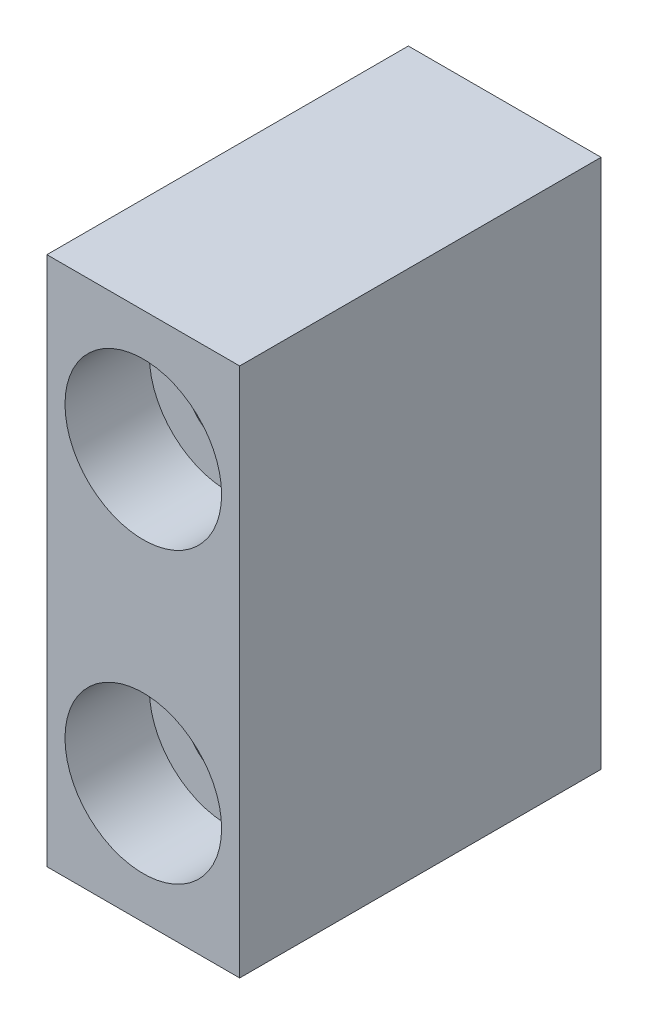
ISO-10303-21;
HEADER;
FILE_DESCRIPTION(('STEP AP214'),'2;1');
FILE_NAME('part.step','',(''),(''),'','','');
FILE_SCHEMA(('AUTOMOTIVE_DESIGN { 1 0 10303 214 1 1 1 1 }'));
ENDSEC;
DATA;
#1=APPLICATION_CONTEXT('core data for automotive mechanical design processes');
#2=APPLICATION_PROTOCOL_DEFINITION('international standard','automotive_design',2000,#1);
#3=PRODUCT_CONTEXT('',#1,'mechanical');
#4=PRODUCT('Part','Part','',(#3));
#5=PRODUCT_RELATED_PRODUCT_CATEGORY('part','',(#4));
#6=PRODUCT_DEFINITION_FORMATION('','',#4);
#7=PRODUCT_DEFINITION_CONTEXT('part definition',#1,'design');
#8=PRODUCT_DEFINITION('design','',#6,#7);
#9=PRODUCT_DEFINITION_SHAPE('','',#8);
#10=(LENGTH_UNIT() NAMED_UNIT(*) SI_UNIT(.MILLI.,.METRE.));
#11=(NAMED_UNIT(*) PLANE_ANGLE_UNIT() SI_UNIT($,.RADIAN.));
#12=(NAMED_UNIT(*) SI_UNIT($,.STERADIAN.) SOLID_ANGLE_UNIT());
#13=UNCERTAINTY_MEASURE_WITH_UNIT(LENGTH_MEASURE(1.E-05),#10,'distance_accuracy_value','');
#14=(GEOMETRIC_REPRESENTATION_CONTEXT(3) GLOBAL_UNCERTAINTY_ASSIGNED_CONTEXT((#13)) GLOBAL_UNIT_ASSIGNED_CONTEXT((#10,
#11,#12)) REPRESENTATION_CONTEXT('',''));
#15=CARTESIAN_POINT('',(0.,0.,0.));
#16=DIRECTION('',(0.,0.,1.));
#17=DIRECTION('',(1.,0.,0.));
#18=AXIS2_PLACEMENT_3D('',#15,#16,#17);
#19=CARTESIAN_POINT('',(-4.,-9.70103092783504,0.));
#20=DIRECTION('',(0.,0.,1.));
#21=DIRECTION('',(1.,0.,0.));
#22=AXIS2_PLACEMENT_3D('',#19,#20,#21);
#23=CYLINDRICAL_SURFACE('',#22,1.75);
#24=CARTESIAN_POINT('',(-4.,-9.70103092783504,0.));
#25=DIRECTION('',(0.,0.,1.));
#26=DIRECTION('',(1.,0.,0.));
#27=AXIS2_PLACEMENT_3D('',#24,#25,#26);
#28=CIRCLE('',#27,1.75);
#29=CARTESIAN_POINT('',(-2.25,-9.70103092783504,0.));
#30=VERTEX_POINT('',#29);
#31=EDGE_CURVE('E110',#30,#30,#28,.T.);
#32=ORIENTED_EDGE('',*,*,#31,.F.);
#33=EDGE_LOOP('',(#32));
#34=FACE_BOUND('',#33,.T.);
#35=CARTESIAN_POINT('',(-4.,-9.70103092783504,11.5));
#36=DIRECTION('',(0.,0.,1.));
#37=DIRECTION('',(1.,0.,0.));
#38=AXIS2_PLACEMENT_3D('',#35,#36,#37);
#39=CIRCLE('',#38,1.75);
#40=CARTESIAN_POINT('',(-2.25,-9.70103092783504,11.5));
#41=VERTEX_POINT('',#40);
#42=EDGE_CURVE('E37',#41,#41,#39,.F.);
#43=ORIENTED_EDGE('',*,*,#42,.F.);
#44=EDGE_LOOP('',(#43));
#45=FACE_BOUND('',#44,.T.);
#46=ADVANCED_FACE('F33',(#34,#45),#23,.F.);
#47=CARTESIAN_POINT('',(-3.99999999999999,2.29896907216496,0.));
#48=DIRECTION('',(0.,0.,1.));
#49=DIRECTION('',(1.,0.,0.));
#50=AXIS2_PLACEMENT_3D('',#47,#48,#49);
#51=CYLINDRICAL_SURFACE('',#50,1.75);
#52=CARTESIAN_POINT('',(-3.99999999999999,2.29896907216496,0.));
#53=DIRECTION('',(0.,0.,1.));
#54=DIRECTION('',(1.,0.,0.));
#55=AXIS2_PLACEMENT_3D('',#52,#53,#54);
#56=CIRCLE('',#55,1.75);
#57=CARTESIAN_POINT('',(-2.25,2.29896907216496,0.));
#58=VERTEX_POINT('',#57);
#59=EDGE_CURVE('E103',#58,#58,#56,.T.);
#60=ORIENTED_EDGE('',*,*,#59,.F.);
#61=EDGE_LOOP('',(#60));
#62=FACE_BOUND('',#61,.T.);
#63=CARTESIAN_POINT('',(-3.99999999999999,2.29896907216496,11.5));
#64=DIRECTION('',(0.,0.,1.));
#65=DIRECTION('',(1.,0.,0.));
#66=AXIS2_PLACEMENT_3D('',#63,#64,#65);
#67=CIRCLE('',#66,1.75);
#68=CARTESIAN_POINT('',(-2.25,2.29896907216496,11.5));
#69=VERTEX_POINT('',#68);
#70=EDGE_CURVE('E108',#69,#69,#67,.F.);
#71=ORIENTED_EDGE('',*,*,#70,.F.);
#72=EDGE_LOOP('',(#71));
#73=FACE_BOUND('',#72,.T.);
#74=ADVANCED_FACE('F133',(#62,#73),#51,.F.);
#75=CARTESIAN_POINT('',(-8.,7.29896907216496,15.));
#76=DIRECTION('',(1.,0.,0.));
#77=DIRECTION('',(0.,1.,0.));
#78=AXIS2_PLACEMENT_3D('',#75,#76,#77);
#79=PLANE('',#78);
#80=DIRECTION('',(0.,-1.,0.));
#81=VECTOR('',#80,1.);
#82=CARTESIAN_POINT('',(-8.,7.29896907216496,0.));
#83=LINE('',#82,#81);
#84=CARTESIAN_POINT('',(-8.,7.29896907216496,0.));
#85=VERTEX_POINT('',#84);
#86=CARTESIAN_POINT('',(-7.99999999999999,-14.701030927835,0.));
#87=VERTEX_POINT('',#86);
#88=EDGE_CURVE('E100',#85,#87,#83,.T.);
#89=ORIENTED_EDGE('',*,*,#88,.T.);
#90=DIRECTION('',(0.,0.,-1.));
#91=VECTOR('',#90,1.);
#92=CARTESIAN_POINT('',(-7.99999999999999,-14.701030927835,15.));
#93=LINE('',#92,#91);
#94=CARTESIAN_POINT('',(-7.99999999999999,-14.701030927835,15.));
#95=VERTEX_POINT('',#94);
#96=EDGE_CURVE('E11',#95,#87,#93,.T.);
#97=ORIENTED_EDGE('',*,*,#96,.F.);
#98=DIRECTION('',(0.,-1.,0.));
#99=VECTOR('',#98,1.);
#100=CARTESIAN_POINT('',(-8.,7.29896907216496,15.));
#101=LINE('',#100,#99);
#102=CARTESIAN_POINT('',(-8.,7.29896907216496,15.));
#103=VERTEX_POINT('',#102);
#104=EDGE_CURVE('E87',#103,#95,#101,.T.);
#105=ORIENTED_EDGE('',*,*,#104,.F.);
#106=DIRECTION('',(0.,0.,-1.));
#107=VECTOR('',#106,1.);
#108=CARTESIAN_POINT('',(-8.,7.29896907216496,15.));
#109=LINE('',#108,#107);
#110=EDGE_CURVE('E96',#103,#85,#109,.T.);
#111=ORIENTED_EDGE('',*,*,#110,.T.);
#112=EDGE_LOOP('',(#89,#97,#105,#111));
#113=FACE_BOUND('',#112,.T.);
#114=ADVANCED_FACE('F35',(#113),#79,.F.);
#115=CARTESIAN_POINT('',(-7.99999999999999,-14.701030927835,15.));
#116=DIRECTION('',(0.,1.,0.));
#117=DIRECTION('',(0.,0.,1.));
#118=AXIS2_PLACEMENT_3D('',#115,#116,#117);
#119=PLANE('',#118);
#120=DIRECTION('',(1.,0.,0.));
#121=VECTOR('',#120,1.);
#122=CARTESIAN_POINT('',(-7.99999999999999,-14.701030927835,0.));
#123=LINE('',#122,#121);
#124=CARTESIAN_POINT('',(0.,-14.701030927835,0.));
#125=VERTEX_POINT('',#124);
#126=EDGE_CURVE('E91',#87,#125,#123,.T.);
#127=ORIENTED_EDGE('',*,*,#126,.T.);
#128=DIRECTION('',(0.,0.,-1.));
#129=VECTOR('',#128,1.);
#130=CARTESIAN_POINT('',(0.,-14.701030927835,15.));
#131=LINE('',#130,#129);
#132=CARTESIAN_POINT('',(0.,-14.701030927835,15.));
#133=VERTEX_POINT('',#132);
#134=EDGE_CURVE('E43',#133,#125,#131,.T.);
#135=ORIENTED_EDGE('',*,*,#134,.F.);
#136=DIRECTION('',(1.,0.,0.));
#137=VECTOR('',#136,1.);
#138=CARTESIAN_POINT('',(-7.99999999999999,-14.701030927835,15.));
#139=LINE('',#138,#137);
#140=EDGE_CURVE('E82',#95,#133,#139,.T.);
#141=ORIENTED_EDGE('',*,*,#140,.F.);
#142=ORIENTED_EDGE('',*,*,#96,.T.);
#143=EDGE_LOOP('',(#127,#135,#141,#142));
#144=FACE_BOUND('',#143,.T.);
#145=ADVANCED_FACE('F90',(#144),#119,.F.);
#146=CARTESIAN_POINT('',(0.,7.29896907216496,15.));
#147=DIRECTION('',(-1.,0.,0.));
#148=DIRECTION('',(0.,-1.,0.));
#149=AXIS2_PLACEMENT_3D('',#146,#147,#148);
#150=PLANE('',#149);
#151=DIRECTION('',(0.,1.,0.));
#152=VECTOR('',#151,1.);
#153=CARTESIAN_POINT('',(0.,7.29896907216496,0.));
#154=LINE('',#153,#152);
#155=CARTESIAN_POINT('',(0.,7.29896907216496,0.));
#156=VERTEX_POINT('',#155);
#157=EDGE_CURVE('E69',#125,#156,#154,.T.);
#158=ORIENTED_EDGE('',*,*,#157,.T.);
#159=DIRECTION('',(0.,0.,-1.));
#160=VECTOR('',#159,1.);
#161=CARTESIAN_POINT('',(0.,7.29896907216496,15.));
#162=LINE('',#161,#160);
#163=CARTESIAN_POINT('',(0.,7.29896907216496,15.));
#164=VERTEX_POINT('',#163);
#165=EDGE_CURVE('E92',#164,#156,#162,.T.);
#166=ORIENTED_EDGE('',*,*,#165,.F.);
#167=DIRECTION('',(0.,1.,0.));
#168=VECTOR('',#167,1.);
#169=CARTESIAN_POINT('',(0.,7.29896907216496,15.));
#170=LINE('',#169,#168);
#171=EDGE_CURVE('E85',#133,#164,#170,.T.);
#172=ORIENTED_EDGE('',*,*,#171,.F.);
#173=ORIENTED_EDGE('',*,*,#134,.T.);
#174=EDGE_LOOP('',(#158,#166,#172,#173));
#175=FACE_BOUND('',#174,.T.);
#176=ADVANCED_FACE('F94',(#175),#150,.F.);
#177=CARTESIAN_POINT('',(-8.,7.29896907216496,15.));
#178=DIRECTION('',(0.,-1.,0.));
#179=DIRECTION('',(0.,0.,-1.));
#180=AXIS2_PLACEMENT_3D('',#177,#178,#179);
#181=PLANE('',#180);
#182=DIRECTION('',(-1.,0.,0.));
#183=VECTOR('',#182,1.);
#184=CARTESIAN_POINT('',(-8.,7.29896907216496,0.));
#185=LINE('',#184,#183);
#186=EDGE_CURVE('E75',#156,#85,#185,.T.);
#187=ORIENTED_EDGE('',*,*,#186,.T.);
#188=ORIENTED_EDGE('',*,*,#110,.F.);
#189=DIRECTION('',(-1.,0.,0.));
#190=VECTOR('',#189,1.);
#191=CARTESIAN_POINT('',(-8.,7.29896907216496,15.));
#192=LINE('',#191,#190);
#193=EDGE_CURVE('E52',#164,#103,#192,.T.);
#194=ORIENTED_EDGE('',*,*,#193,.F.);
#195=ORIENTED_EDGE('',*,*,#165,.T.);
#196=EDGE_LOOP('',(#187,#188,#194,#195));
#197=FACE_BOUND('',#196,.T.);
#198=ADVANCED_FACE('F148',(#197),#181,.F.);
#199=CARTESIAN_POINT('',(0.,0.,15.));
#200=DIRECTION('',(0.,0.,1.));
#201=DIRECTION('',(1.,0.,0.));
#202=AXIS2_PLACEMENT_3D('',#199,#200,#201);
#203=PLANE('',#202);
#204=CARTESIAN_POINT('',(-4.,-9.70103092783504,15.));
#205=DIRECTION('',(0.,0.,1.));
#206=DIRECTION('',(1.,0.,0.));
#207=AXIS2_PLACEMENT_3D('',#204,#205,#206);
#208=CIRCLE('',#207,3.25);
#209=CARTESIAN_POINT('',(-0.749999999999996,-9.70103092783504,15.));
#210=VERTEX_POINT('',#209);
#211=EDGE_CURVE('E124',#210,#210,#208,.T.);
#212=ORIENTED_EDGE('',*,*,#211,.F.);
#213=EDGE_LOOP('',(#212));
#214=FACE_BOUND('',#213,.T.);
#215=CARTESIAN_POINT('',(-3.99999999999999,2.29896907216496,15.));
#216=DIRECTION('',(0.,0.,1.));
#217=DIRECTION('',(1.,0.,0.));
#218=AXIS2_PLACEMENT_3D('',#215,#216,#217);
#219=CIRCLE('',#218,3.25);
#220=CARTESIAN_POINT('',(-0.749999999999995,2.29896907216496,15.));
#221=VERTEX_POINT('',#220);
#222=EDGE_CURVE('E117',#221,#221,#219,.T.);
#223=ORIENTED_EDGE('',*,*,#222,.F.);
#224=EDGE_LOOP('',(#223));
#225=FACE_BOUND('',#224,.T.);
#226=ORIENTED_EDGE('',*,*,#104,.T.);
#227=ORIENTED_EDGE('',*,*,#140,.T.);
#228=ORIENTED_EDGE('',*,*,#171,.T.);
#229=ORIENTED_EDGE('',*,*,#193,.T.);
#230=EDGE_LOOP('',(#226,#227,#228,#229));
#231=FACE_BOUND('',#230,.T.);
#232=ADVANCED_FACE('F83',(#214,#225,#231),#203,.T.);
#233=CARTESIAN_POINT('',(0.,0.,0.));
#234=DIRECTION('',(0.,0.,1.));
#235=DIRECTION('',(1.,0.,0.));
#236=AXIS2_PLACEMENT_3D('',#233,#234,#235);
#237=PLANE('',#236);
#238=ORIENTED_EDGE('',*,*,#31,.T.);
#239=EDGE_LOOP('',(#238));
#240=FACE_BOUND('',#239,.T.);
#241=ORIENTED_EDGE('',*,*,#59,.T.);
#242=EDGE_LOOP('',(#241));
#243=FACE_BOUND('',#242,.T.);
#244=ORIENTED_EDGE('',*,*,#88,.F.);
#245=ORIENTED_EDGE('',*,*,#186,.F.);
#246=ORIENTED_EDGE('',*,*,#157,.F.);
#247=ORIENTED_EDGE('',*,*,#126,.F.);
#248=EDGE_LOOP('',(#244,#245,#246,#247));
#249=FACE_BOUND('',#248,.T.);
#250=ADVANCED_FACE('F130',(#240,#243,#249),#237,.F.);
#251=CARTESIAN_POINT('',(-3.99999999999999,2.29896907216496,11.5));
#252=DIRECTION('',(0.,0.,1.));
#253=DIRECTION('',(1.,0.,0.));
#254=AXIS2_PLACEMENT_3D('',#251,#252,#253);
#255=PLANE('',#254);
#256=CARTESIAN_POINT('',(-3.99999999999999,2.29896907216496,11.5));
#257=DIRECTION('',(0.,0.,1.));
#258=DIRECTION('',(1.,0.,0.));
#259=AXIS2_PLACEMENT_3D('',#256,#257,#258);
#260=CIRCLE('',#259,3.25);
#261=CARTESIAN_POINT('',(-0.749999999999995,2.29896907216496,11.5));
#262=VERTEX_POINT('',#261);
#263=EDGE_CURVE('E111',#262,#262,#260,.T.);
#264=ORIENTED_EDGE('',*,*,#263,.T.);
#265=EDGE_LOOP('',(#264));
#266=FACE_BOUND('',#265,.T.);
#267=ORIENTED_EDGE('',*,*,#70,.T.);
#268=EDGE_LOOP('',(#267));
#269=FACE_BOUND('',#268,.T.);
#270=ADVANCED_FACE('F152',(#266,#269),#255,.T.);
#271=CARTESIAN_POINT('',(-3.99999999999999,2.29896907216496,11.5));
#272=DIRECTION('',(0.,0.,1.));
#273=DIRECTION('',(1.,0.,0.));
#274=AXIS2_PLACEMENT_3D('',#271,#272,#273);
#275=CYLINDRICAL_SURFACE('',#274,3.25);
#276=ORIENTED_EDGE('',*,*,#263,.F.);
#277=EDGE_LOOP('',(#276));
#278=FACE_BOUND('',#277,.T.);
#279=ORIENTED_EDGE('',*,*,#222,.T.);
#280=EDGE_LOOP('',(#279));
#281=FACE_BOUND('',#280,.T.);
#282=ADVANCED_FACE('F185',(#278,#281),#275,.F.);
#283=CARTESIAN_POINT('',(-4.,-9.70103092783504,11.5));
#284=DIRECTION('',(0.,0.,1.));
#285=DIRECTION('',(1.,0.,0.));
#286=AXIS2_PLACEMENT_3D('',#283,#284,#285);
#287=PLANE('',#286);
#288=CARTESIAN_POINT('',(-4.,-9.70103092783504,11.5));
#289=DIRECTION('',(0.,0.,1.));
#290=DIRECTION('',(1.,0.,0.));
#291=AXIS2_PLACEMENT_3D('',#288,#289,#290);
#292=CIRCLE('',#291,3.25);
#293=CARTESIAN_POINT('',(-0.749999999999996,-9.70103092783504,11.5));
#294=VERTEX_POINT('',#293);
#295=EDGE_CURVE('E244',#294,#294,#292,.T.);
#296=ORIENTED_EDGE('',*,*,#295,.T.);
#297=EDGE_LOOP('',(#296));
#298=FACE_BOUND('',#297,.T.);
#299=ORIENTED_EDGE('',*,*,#42,.T.);
#300=EDGE_LOOP('',(#299));
#301=FACE_BOUND('',#300,.T.);
#302=ADVANCED_FACE('F192',(#298,#301),#287,.T.);
#303=CARTESIAN_POINT('',(-4.,-9.70103092783504,11.5));
#304=DIRECTION('',(0.,0.,1.));
#305=DIRECTION('',(1.,0.,0.));
#306=AXIS2_PLACEMENT_3D('',#303,#304,#305);
#307=CYLINDRICAL_SURFACE('',#306,3.25);
#308=ORIENTED_EDGE('',*,*,#295,.F.);
#309=EDGE_LOOP('',(#308));
#310=FACE_BOUND('',#309,.T.);
#311=ORIENTED_EDGE('',*,*,#211,.T.);
#312=EDGE_LOOP('',(#311));
#313=FACE_BOUND('',#312,.T.);
#314=ADVANCED_FACE('F199',(#310,#313),#307,.F.);
#315=CLOSED_SHELL('',(#46,#74,#114,#145,#176,#198,#232,#250,#270,#282,#302,#314));
#316=MANIFOLD_SOLID_BREP('B2',#315);
#317=ADVANCED_BREP_SHAPE_REPRESENTATION('',(#18,#316),#14);
#318=SHAPE_DEFINITION_REPRESENTATION(#9,#317);
ENDSEC;
END-ISO-10303-21;
